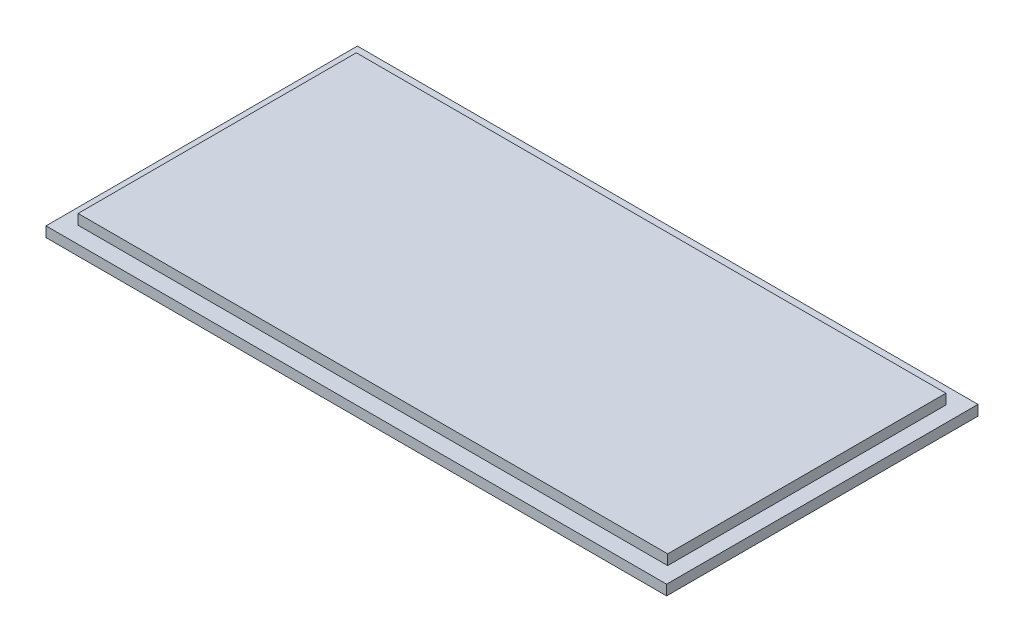
ISO-10303-21;
HEADER;
FILE_DESCRIPTION(('STEP AP214'),'2;1');
FILE_NAME('part.step','',(''),(''),'','','');
FILE_SCHEMA(('AUTOMOTIVE_DESIGN { 1 0 10303 214 1 1 1 1 }'));
ENDSEC;
DATA;
#1=APPLICATION_CONTEXT('core data for automotive mechanical design processes');
#2=APPLICATION_PROTOCOL_DEFINITION('international standard','automotive_design',2000,#1);
#3=PRODUCT_CONTEXT('',#1,'mechanical');
#4=PRODUCT('Part','Part','',(#3));
#5=PRODUCT_RELATED_PRODUCT_CATEGORY('part','',(#4));
#6=PRODUCT_DEFINITION_FORMATION('','',#4);
#7=PRODUCT_DEFINITION_CONTEXT('part definition',#1,'design');
#8=PRODUCT_DEFINITION('design','',#6,#7);
#9=PRODUCT_DEFINITION_SHAPE('','',#8);
#10=(LENGTH_UNIT() NAMED_UNIT(*) SI_UNIT(.MILLI.,.METRE.));
#11=(NAMED_UNIT(*) PLANE_ANGLE_UNIT() SI_UNIT($,.RADIAN.));
#12=(NAMED_UNIT(*) SI_UNIT($,.STERADIAN.) SOLID_ANGLE_UNIT());
#13=UNCERTAINTY_MEASURE_WITH_UNIT(LENGTH_MEASURE(1.E-05),#10,'distance_accuracy_value','');
#14=(GEOMETRIC_REPRESENTATION_CONTEXT(3) GLOBAL_UNCERTAINTY_ASSIGNED_CONTEXT((#13)) GLOBAL_UNIT_ASSIGNED_CONTEXT((#10,
#11,#12)) REPRESENTATION_CONTEXT('',''));
#15=CARTESIAN_POINT('',(0.,0.,0.));
#16=DIRECTION('',(0.,0.,1.));
#17=DIRECTION('',(1.,0.,0.));
#18=AXIS2_PLACEMENT_3D('',#15,#16,#17);
#19=CARTESIAN_POINT('',(60.785,2.,-30.5));
#20=DIRECTION('',(-1.,0.,0.));
#21=DIRECTION('',(0.,0.,1.));
#22=AXIS2_PLACEMENT_3D('',#19,#20,#21);
#23=PLANE('',#22);
#24=DIRECTION('',(0.,0.,-1.));
#25=VECTOR('',#24,1.);
#26=CARTESIAN_POINT('',(60.785,0.,-30.5));
#27=LINE('',#26,#25);
#28=CARTESIAN_POINT('',(60.785,0.,30.5));
#29=VERTEX_POINT('',#28);
#30=CARTESIAN_POINT('',(60.785,0.,-30.5));
#31=VERTEX_POINT('',#30);
#32=EDGE_CURVE('E133',#29,#31,#27,.T.);
#33=ORIENTED_EDGE('',*,*,#32,.T.);
#34=DIRECTION('',(0.,-1.,0.));
#35=VECTOR('',#34,1.);
#36=CARTESIAN_POINT('',(60.785,2.,-30.5));
#37=LINE('',#36,#35);
#38=CARTESIAN_POINT('',(60.785,2.,-30.5));
#39=VERTEX_POINT('',#38);
#40=EDGE_CURVE('E11',#39,#31,#37,.T.);
#41=ORIENTED_EDGE('',*,*,#40,.F.);
#42=DIRECTION('',(0.,0.,-1.));
#43=VECTOR('',#42,1.);
#44=CARTESIAN_POINT('',(60.785,2.,-30.5));
#45=LINE('',#44,#43);
#46=CARTESIAN_POINT('',(60.785,2.,30.5));
#47=VERTEX_POINT('',#46);
#48=EDGE_CURVE('E144',#47,#39,#45,.T.);
#49=ORIENTED_EDGE('',*,*,#48,.F.);
#50=DIRECTION('',(0.,-1.,0.));
#51=VECTOR('',#50,1.);
#52=CARTESIAN_POINT('',(60.785,2.,30.5));
#53=LINE('',#52,#51);
#54=EDGE_CURVE('E157',#47,#29,#53,.T.);
#55=ORIENTED_EDGE('',*,*,#54,.T.);
#56=EDGE_LOOP('',(#33,#41,#49,#55));
#57=FACE_BOUND('',#56,.T.);
#58=ADVANCED_FACE('F45',(#57),#23,.F.);
#59=CARTESIAN_POINT('',(-60.785,2.,-30.5));
#60=DIRECTION('',(0.,0.,1.));
#61=DIRECTION('',(1.,0.,0.));
#62=AXIS2_PLACEMENT_3D('',#59,#60,#61);
#63=PLANE('',#62);
#64=DIRECTION('',(-1.,0.,0.));
#65=VECTOR('',#64,1.);
#66=CARTESIAN_POINT('',(-60.785,0.,-30.5));
#67=LINE('',#66,#65);
#68=CARTESIAN_POINT('',(-60.785,0.,-30.5));
#69=VERTEX_POINT('',#68);
#70=EDGE_CURVE('E138',#31,#69,#67,.T.);
#71=ORIENTED_EDGE('',*,*,#70,.T.);
#72=DIRECTION('',(0.,-1.,0.));
#73=VECTOR('',#72,1.);
#74=CARTESIAN_POINT('',(-60.785,2.,-30.5));
#75=LINE('',#74,#73);
#76=CARTESIAN_POINT('',(-60.785,2.,-30.5));
#77=VERTEX_POINT('',#76);
#78=EDGE_CURVE('E53',#77,#69,#75,.T.);
#79=ORIENTED_EDGE('',*,*,#78,.F.);
#80=DIRECTION('',(-1.,0.,0.));
#81=VECTOR('',#80,1.);
#82=CARTESIAN_POINT('',(-60.785,2.,-30.5));
#83=LINE('',#82,#81);
#84=EDGE_CURVE('E148',#39,#77,#83,.T.);
#85=ORIENTED_EDGE('',*,*,#84,.F.);
#86=ORIENTED_EDGE('',*,*,#40,.T.);
#87=EDGE_LOOP('',(#71,#79,#85,#86));
#88=FACE_BOUND('',#87,.T.);
#89=ADVANCED_FACE('F194',(#88),#63,.F.);
#90=CARTESIAN_POINT('',(-60.785,2.,-30.5));
#91=DIRECTION('',(1.,0.,0.));
#92=DIRECTION('',(0.,0.,-1.));
#93=AXIS2_PLACEMENT_3D('',#90,#91,#92);
#94=PLANE('',#93);
#95=DIRECTION('',(0.,0.,1.));
#96=VECTOR('',#95,1.);
#97=CARTESIAN_POINT('',(-60.785,0.,-30.5));
#98=LINE('',#97,#96);
#99=CARTESIAN_POINT('',(-60.785,0.,30.5));
#100=VERTEX_POINT('',#99);
#101=EDGE_CURVE('E161',#69,#100,#98,.T.);
#102=ORIENTED_EDGE('',*,*,#101,.T.);
#103=DIRECTION('',(0.,-1.,0.));
#104=VECTOR('',#103,1.);
#105=CARTESIAN_POINT('',(-60.785,2.,30.5));
#106=LINE('',#105,#104);
#107=CARTESIAN_POINT('',(-60.785,2.,30.5));
#108=VERTEX_POINT('',#107);
#109=EDGE_CURVE('E169',#108,#100,#106,.T.);
#110=ORIENTED_EDGE('',*,*,#109,.F.);
#111=DIRECTION('',(0.,0.,1.));
#112=VECTOR('',#111,1.);
#113=CARTESIAN_POINT('',(-60.785,2.,-30.5));
#114=LINE('',#113,#112);
#115=EDGE_CURVE('E152',#77,#108,#114,.T.);
#116=ORIENTED_EDGE('',*,*,#115,.F.);
#117=ORIENTED_EDGE('',*,*,#78,.T.);
#118=EDGE_LOOP('',(#102,#110,#116,#117));
#119=FACE_BOUND('',#118,.T.);
#120=ADVANCED_FACE('F178',(#119),#94,.F.);
#121=CARTESIAN_POINT('',(-60.785,2.,30.5));
#122=DIRECTION('',(0.,0.,-1.));
#123=DIRECTION('',(-1.,0.,0.));
#124=AXIS2_PLACEMENT_3D('',#121,#122,#123);
#125=PLANE('',#124);
#126=DIRECTION('',(1.,0.,0.));
#127=VECTOR('',#126,1.);
#128=CARTESIAN_POINT('',(-60.785,0.,30.5));
#129=LINE('',#128,#127);
#130=EDGE_CURVE('E149',#100,#29,#129,.T.);
#131=ORIENTED_EDGE('',*,*,#130,.T.);
#132=ORIENTED_EDGE('',*,*,#54,.F.);
#133=DIRECTION('',(1.,0.,0.));
#134=VECTOR('',#133,1.);
#135=CARTESIAN_POINT('',(-60.785,2.,30.5));
#136=LINE('',#135,#134);
#137=EDGE_CURVE('E155',#108,#47,#136,.T.);
#138=ORIENTED_EDGE('',*,*,#137,.F.);
#139=ORIENTED_EDGE('',*,*,#109,.T.);
#140=EDGE_LOOP('',(#131,#132,#138,#139));
#141=FACE_BOUND('',#140,.T.);
#142=ADVANCED_FACE('F187',(#141),#125,.F.);
#143=CARTESIAN_POINT('',(0.,2.,0.));
#144=DIRECTION('',(0.,1.,0.));
#145=DIRECTION('',(0.,0.,1.));
#146=AXIS2_PLACEMENT_3D('',#143,#144,#145);
#147=PLANE('',#146);
#148=DIRECTION('',(0.,0.,-1.));
#149=VECTOR('',#148,1.);
#150=CARTESIAN_POINT('',(57.75,2.,-27.25));
#151=LINE('',#150,#149);
#152=CARTESIAN_POINT('',(57.75,2.,27.25));
#153=VERTEX_POINT('',#152);
#154=CARTESIAN_POINT('',(57.75,2.,-27.25));
#155=VERTEX_POINT('',#154);
#156=EDGE_CURVE('E60',#153,#155,#151,.T.);
#157=ORIENTED_EDGE('',*,*,#156,.F.);
#158=DIRECTION('',(1.,0.,0.));
#159=VECTOR('',#158,1.);
#160=CARTESIAN_POINT('',(-57.75,2.,27.25));
#161=LINE('',#160,#159);
#162=CARTESIAN_POINT('',(-57.75,2.,27.25));
#163=VERTEX_POINT('',#162);
#164=EDGE_CURVE('E64',#163,#153,#161,.T.);
#165=ORIENTED_EDGE('',*,*,#164,.F.);
#166=DIRECTION('',(0.,0.,1.));
#167=VECTOR('',#166,1.);
#168=CARTESIAN_POINT('',(-57.75,2.,-27.25));
#169=LINE('',#168,#167);
#170=CARTESIAN_POINT('',(-57.75,2.,-27.25));
#171=VERTEX_POINT('',#170);
#172=EDGE_CURVE('E289',#171,#163,#169,.T.);
#173=ORIENTED_EDGE('',*,*,#172,.F.);
#174=DIRECTION('',(-1.,0.,0.));
#175=VECTOR('',#174,1.);
#176=CARTESIAN_POINT('',(-57.75,2.,-27.25));
#177=LINE('',#176,#175);
#178=EDGE_CURVE('E299',#155,#171,#177,.T.);
#179=ORIENTED_EDGE('',*,*,#178,.F.);
#180=EDGE_LOOP('',(#157,#165,#173,#179));
#181=FACE_BOUND('',#180,.T.);
#182=ORIENTED_EDGE('',*,*,#48,.T.);
#183=ORIENTED_EDGE('',*,*,#84,.T.);
#184=ORIENTED_EDGE('',*,*,#115,.T.);
#185=ORIENTED_EDGE('',*,*,#137,.T.);
#186=EDGE_LOOP('',(#182,#183,#184,#185));
#187=FACE_BOUND('',#186,.T.);
#188=ADVANCED_FACE('F193',(#181,#187),#147,.T.);
#189=CARTESIAN_POINT('',(0.,0.,0.));
#190=DIRECTION('',(0.,1.,0.));
#191=DIRECTION('',(0.,0.,1.));
#192=AXIS2_PLACEMENT_3D('',#189,#190,#191);
#193=PLANE('',#192);
#194=ORIENTED_EDGE('',*,*,#32,.F.);
#195=ORIENTED_EDGE('',*,*,#130,.F.);
#196=ORIENTED_EDGE('',*,*,#101,.F.);
#197=ORIENTED_EDGE('',*,*,#70,.F.);
#198=EDGE_LOOP('',(#194,#195,#196,#197));
#199=FACE_BOUND('',#198,.T.);
#200=ADVANCED_FACE('F184',(#199),#193,.F.);
#201=CARTESIAN_POINT('',(57.75,4.,-27.25));
#202=DIRECTION('',(-1.,0.,0.));
#203=DIRECTION('',(0.,0.,1.));
#204=AXIS2_PLACEMENT_3D('',#201,#202,#203);
#205=PLANE('',#204);
#206=ORIENTED_EDGE('',*,*,#156,.T.);
#207=DIRECTION('',(0.,-1.,0.));
#208=VECTOR('',#207,1.);
#209=CARTESIAN_POINT('',(57.75,4.,-27.25));
#210=LINE('',#209,#208);
#211=CARTESIAN_POINT('',(57.75,4.,-27.25));
#212=VERTEX_POINT('',#211);
#213=EDGE_CURVE('E113',#212,#155,#210,.T.);
#214=ORIENTED_EDGE('',*,*,#213,.F.);
#215=DIRECTION('',(0.,0.,-1.));
#216=VECTOR('',#215,1.);
#217=CARTESIAN_POINT('',(57.75,4.,-27.25));
#218=LINE('',#217,#216);
#219=CARTESIAN_POINT('',(57.75,4.,27.25));
#220=VERTEX_POINT('',#219);
#221=EDGE_CURVE('E120',#220,#212,#218,.T.);
#222=ORIENTED_EDGE('',*,*,#221,.F.);
#223=DIRECTION('',(0.,-1.,0.));
#224=VECTOR('',#223,1.);
#225=CARTESIAN_POINT('',(57.75,4.,27.25));
#226=LINE('',#225,#224);
#227=EDGE_CURVE('E286',#220,#153,#226,.T.);
#228=ORIENTED_EDGE('',*,*,#227,.T.);
#229=EDGE_LOOP('',(#206,#214,#222,#228));
#230=FACE_BOUND('',#229,.T.);
#231=ADVANCED_FACE('F131',(#230),#205,.F.);
#232=CARTESIAN_POINT('',(-57.75,4.,-27.25));
#233=DIRECTION('',(0.,0.,1.));
#234=DIRECTION('',(1.,0.,0.));
#235=AXIS2_PLACEMENT_3D('',#232,#233,#234);
#236=PLANE('',#235);
#237=ORIENTED_EDGE('',*,*,#178,.T.);
#238=DIRECTION('',(0.,-1.,0.));
#239=VECTOR('',#238,1.);
#240=CARTESIAN_POINT('',(-57.75,4.,-27.25));
#241=LINE('',#240,#239);
#242=CARTESIAN_POINT('',(-57.75,4.,-27.25));
#243=VERTEX_POINT('',#242);
#244=EDGE_CURVE('E115',#243,#171,#241,.T.);
#245=ORIENTED_EDGE('',*,*,#244,.F.);
#246=DIRECTION('',(-1.,0.,0.));
#247=VECTOR('',#246,1.);
#248=CARTESIAN_POINT('',(-57.75,4.,-27.25));
#249=LINE('',#248,#247);
#250=EDGE_CURVE('E108',#212,#243,#249,.T.);
#251=ORIENTED_EDGE('',*,*,#250,.F.);
#252=ORIENTED_EDGE('',*,*,#213,.T.);
#253=EDGE_LOOP('',(#237,#245,#251,#252));
#254=FACE_BOUND('',#253,.T.);
#255=ADVANCED_FACE('F111',(#254),#236,.F.);
#256=CARTESIAN_POINT('',(-57.75,4.,-27.25));
#257=DIRECTION('',(1.,0.,0.));
#258=DIRECTION('',(0.,0.,-1.));
#259=AXIS2_PLACEMENT_3D('',#256,#257,#258);
#260=PLANE('',#259);
#261=ORIENTED_EDGE('',*,*,#172,.T.);
#262=DIRECTION('',(0.,-1.,0.));
#263=VECTOR('',#262,1.);
#264=CARTESIAN_POINT('',(-57.75,4.,27.25));
#265=LINE('',#264,#263);
#266=CARTESIAN_POINT('',(-57.75,4.,27.25));
#267=VERTEX_POINT('',#266);
#268=EDGE_CURVE('E140',#267,#163,#265,.T.);
#269=ORIENTED_EDGE('',*,*,#268,.F.);
#270=DIRECTION('',(0.,0.,1.));
#271=VECTOR('',#270,1.);
#272=CARTESIAN_POINT('',(-57.75,4.,-27.25));
#273=LINE('',#272,#271);
#274=EDGE_CURVE('E119',#243,#267,#273,.T.);
#275=ORIENTED_EDGE('',*,*,#274,.F.);
#276=ORIENTED_EDGE('',*,*,#244,.T.);
#277=EDGE_LOOP('',(#261,#269,#275,#276));
#278=FACE_BOUND('',#277,.T.);
#279=ADVANCED_FACE('F212',(#278),#260,.F.);
#280=CARTESIAN_POINT('',(-57.75,4.,27.25));
#281=DIRECTION('',(0.,0.,-1.));
#282=DIRECTION('',(-1.,0.,0.));
#283=AXIS2_PLACEMENT_3D('',#280,#281,#282);
#284=PLANE('',#283);
#285=ORIENTED_EDGE('',*,*,#164,.T.);
#286=ORIENTED_EDGE('',*,*,#227,.F.);
#287=DIRECTION('',(1.,0.,0.));
#288=VECTOR('',#287,1.);
#289=CARTESIAN_POINT('',(-57.75,4.,27.25));
#290=LINE('',#289,#288);
#291=EDGE_CURVE('E125',#267,#220,#290,.T.);
#292=ORIENTED_EDGE('',*,*,#291,.F.);
#293=ORIENTED_EDGE('',*,*,#268,.T.);
#294=EDGE_LOOP('',(#285,#286,#292,#293));
#295=FACE_BOUND('',#294,.T.);
#296=ADVANCED_FACE('F215',(#295),#284,.F.);
#297=CARTESIAN_POINT('',(0.,4.,0.));
#298=DIRECTION('',(0.,1.,0.));
#299=DIRECTION('',(0.,0.,1.));
#300=AXIS2_PLACEMENT_3D('',#297,#298,#299);
#301=PLANE('',#300);
#302=ORIENTED_EDGE('',*,*,#221,.T.);
#303=ORIENTED_EDGE('',*,*,#250,.T.);
#304=ORIENTED_EDGE('',*,*,#274,.T.);
#305=ORIENTED_EDGE('',*,*,#291,.T.);
#306=EDGE_LOOP('',(#302,#303,#304,#305));
#307=FACE_BOUND('',#306,.T.);
#308=ADVANCED_FACE('F123',(#307),#301,.T.);
#309=CLOSED_SHELL('',(#58,#89,#120,#142,#188,#200,#231,#255,#279,#296,#308));
#310=MANIFOLD_SOLID_BREP('B2',#309);
#311=ADVANCED_BREP_SHAPE_REPRESENTATION('',(#18,#310),#14);
#312=SHAPE_DEFINITION_REPRESENTATION(#9,#311);
ENDSEC;
END-ISO-10303-21;
